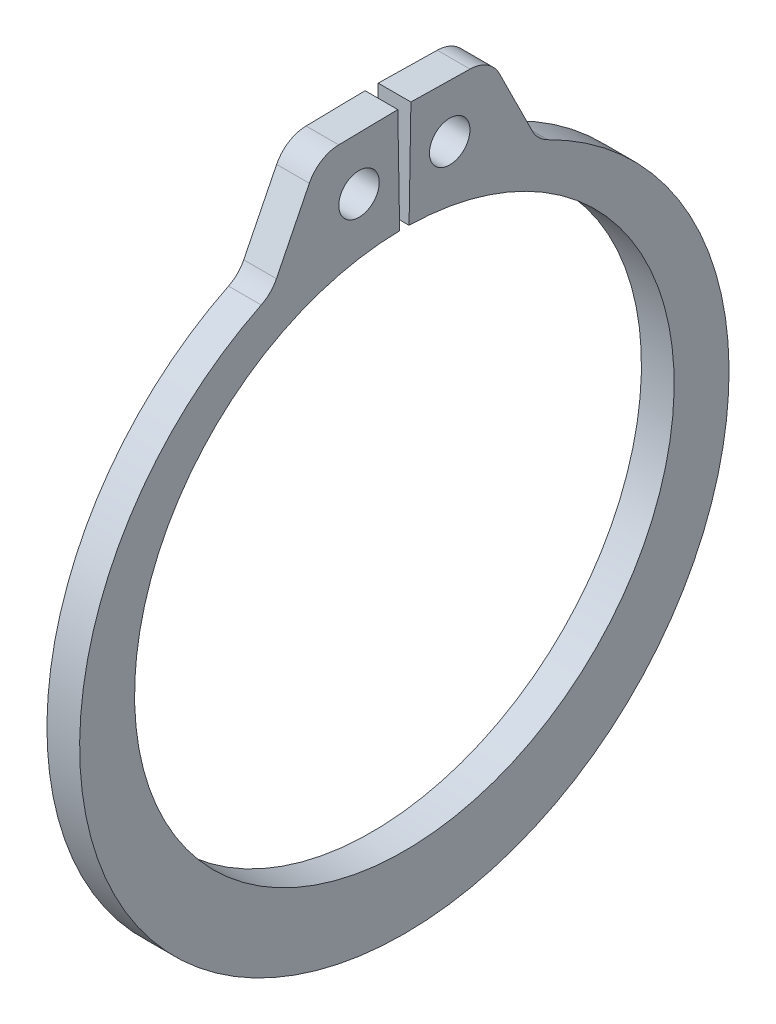
ISO-10303-21;
HEADER;
FILE_DESCRIPTION(('STEP AP214'),'2;1');
FILE_NAME('part.step','',(''),(''),'','','');
FILE_SCHEMA(('AUTOMOTIVE_DESIGN { 1 0 10303 214 1 1 1 1 }'));
ENDSEC;
DATA;
#1=APPLICATION_CONTEXT('core data for automotive mechanical design processes');
#2=APPLICATION_PROTOCOL_DEFINITION('international standard','automotive_design',2000,#1);
#3=PRODUCT_CONTEXT('',#1,'mechanical');
#4=PRODUCT('Part','Part','',(#3));
#5=PRODUCT_RELATED_PRODUCT_CATEGORY('part','',(#4));
#6=PRODUCT_DEFINITION_FORMATION('','',#4);
#7=PRODUCT_DEFINITION_CONTEXT('part definition',#1,'design');
#8=PRODUCT_DEFINITION('design','',#6,#7);
#9=PRODUCT_DEFINITION_SHAPE('','',#8);
#10=(LENGTH_UNIT() NAMED_UNIT(*) SI_UNIT(.MILLI.,.METRE.));
#11=(NAMED_UNIT(*) PLANE_ANGLE_UNIT() SI_UNIT($,.RADIAN.));
#12=(NAMED_UNIT(*) SI_UNIT($,.STERADIAN.) SOLID_ANGLE_UNIT());
#13=UNCERTAINTY_MEASURE_WITH_UNIT(LENGTH_MEASURE(1.E-05),#10,'distance_accuracy_value','');
#14=(GEOMETRIC_REPRESENTATION_CONTEXT(3) GLOBAL_UNCERTAINTY_ASSIGNED_CONTEXT((#13)) GLOBAL_UNIT_ASSIGNED_CONTEXT((#10,
#11,#12)) REPRESENTATION_CONTEXT('',''));
#15=CARTESIAN_POINT('',(0.,0.,0.));
#16=DIRECTION('',(0.,0.,1.));
#17=DIRECTION('',(1.,0.,0.));
#18=AXIS2_PLACEMENT_3D('',#15,#16,#17);
#19=CARTESIAN_POINT('',(0.5334,0.,0.));
#20=DIRECTION('',(1.,0.,0.));
#21=DIRECTION('',(0.,0.,1.));
#22=AXIS2_PLACEMENT_3D('',#19,#20,#21);
#23=PLANE('',#22);
#24=CARTESIAN_POINT('',(0.5334,10.5040886416162,1.47894687499924));
#25=DIRECTION('',(1.,0.,0.));
#26=DIRECTION('',(0.,0.,-1.));
#27=AXIS2_PLACEMENT_3D('',#24,#25,#26);
#28=CIRCLE('',#27,0.6604);
#29=CARTESIAN_POINT('',(0.5334,10.5040886416162,0.818546874999241));
#30=VERTEX_POINT('',#29);
#31=EDGE_CURVE('E123',#30,#30,#28,.T.);
#32=ORIENTED_EDGE('',*,*,#31,.F.);
#33=EDGE_LOOP('',(#32));
#34=FACE_BOUND('',#33,.T.);
#35=CARTESIAN_POINT('',(0.5334,0.,0.));
#36=DIRECTION('',(1.,0.,0.));
#37=DIRECTION('',(0.,0.,-1.));
#38=AXIS2_PLACEMENT_3D('',#35,#36,#37);
#39=CIRCLE('',#38,8.8011);
#40=CARTESIAN_POINT('',(0.5334,8.79975954984091,0.153600374295176));
#41=VERTEX_POINT('',#40);
#42=CARTESIAN_POINT('',(0.5334,8.79975954984091,-0.153600374295176));
#43=VERTEX_POINT('',#42);
#44=EDGE_CURVE('E153',#41,#43,#39,.T.);
#45=ORIENTED_EDGE('',*,*,#44,.F.);
#46=DIRECTION('',(0.,0.999847695156391,0.0174524064372835));
#47=VECTOR('',#46,1.);
#48=CARTESIAN_POINT('',(0.5334,8.79975954984091,0.153600374295176));
#49=LINE('',#48,#47);
#50=CARTESIAN_POINT('',(0.5334,12.2536334279892,0.213887967092128));
#51=VERTEX_POINT('',#50);
#52=EDGE_CURVE('E199',#51,#41,#49,.F.);
#53=ORIENTED_EDGE('',*,*,#52,.F.);
#54=DIRECTION('',(0.,-0.0174524064372834,0.999847695156391));
#55=VECTOR('',#54,1.);
#56=CARTESIAN_POINT('',(0.5334,12.2536334279892,0.213887967092128));
#57=LINE('',#56,#55);
#58=CARTESIAN_POINT('',(0.5334,12.21999978275,2.14075821234738));
#59=VERTEX_POINT('',#58);
#60=EDGE_CURVE('E192',#59,#51,#57,.F.);
#61=ORIENTED_EDGE('',*,*,#60,.F.);
#62=CARTESIAN_POINT('',(0.5334,11.1279661301002,2.12169669403658));
#63=DIRECTION('',(1.,0.,0.));
#64=DIRECTION('',(0.,0.,-1.));
#65=AXIS2_PLACEMENT_3D('',#62,#63,#64);
#66=CIRCLE('',#65,1.0922);
#67=CARTESIAN_POINT('',(0.5334,11.6141614114107,3.09971253666458));
#68=VERTEX_POINT('',#67);
#69=EDGE_CURVE('E148',#59,#68,#66,.T.);
#70=ORIENTED_EDGE('',*,*,#69,.T.);
#71=DIRECTION('',(0.,-0.895454900776411,0.445152244378829));
#72=VECTOR('',#71,1.);
#73=CARTESIAN_POINT('',(0.5334,12.2084177333914,2.80429337570331));
#74=LINE('',#73,#72);
#75=CARTESIAN_POINT('',(0.5334,9.45539137797145,4.17288922557434));
#76=VERTEX_POINT('',#75);
#77=EDGE_CURVE('E152',#76,#68,#74,.F.);
#78=ORIENTED_EDGE('',*,*,#77,.F.);
#79=CARTESIAN_POINT('',(0.5334,9.941586659282,5.15090506820234));
#80=DIRECTION('',(1.,0.,0.));
#81=DIRECTION('',(0.,0.,-1.));
#82=AXIS2_PLACEMENT_3D('',#79,#80,#81);
#83=CIRCLE('',#82,1.0922);
#84=CARTESIAN_POINT('',(0.5334,8.96124610534802,4.66941442622431));
#85=VERTEX_POINT('',#84);
#86=EDGE_CURVE('E144',#85,#76,#83,.T.);
#87=ORIENTED_EDGE('',*,*,#86,.F.);
#88=CARTESIAN_POINT('',(0.5334,-0.545929997486656,0.));
#89=DIRECTION('',(1.,0.,0.));
#90=DIRECTION('',(0.,0.,-1.));
#91=AXIS2_PLACEMENT_3D('',#88,#89,#90);
#92=CIRCLE('',#91,10.5919700025133);
#93=CARTESIAN_POINT('',(0.5334,8.96124610534802,-4.66941442622431));
#94=VERTEX_POINT('',#93);
#95=EDGE_CURVE('E137',#85,#94,#92,.T.);
#96=ORIENTED_EDGE('',*,*,#95,.T.);
#97=CARTESIAN_POINT('',(0.5334,9.941586659282,-5.15090506820234));
#98=DIRECTION('',(1.,0.,0.));
#99=DIRECTION('',(0.,0.,-1.));
#100=AXIS2_PLACEMENT_3D('',#97,#98,#99);
#101=CIRCLE('',#100,1.0922);
#102=CARTESIAN_POINT('',(0.5334,9.45539137797145,-4.17288922557434));
#103=VERTEX_POINT('',#102);
#104=EDGE_CURVE('E119',#103,#94,#101,.T.);
#105=ORIENTED_EDGE('',*,*,#104,.F.);
#106=DIRECTION('',(0.,0.895454900776411,0.445152244378829));
#107=VECTOR('',#106,1.);
#108=CARTESIAN_POINT('',(0.5334,12.2084177333914,-2.80429337570331));
#109=LINE('',#108,#107);
#110=CARTESIAN_POINT('',(0.5334,11.6141614114107,-3.09971253666458));
#111=VERTEX_POINT('',#110);
#112=EDGE_CURVE('E124',#111,#103,#109,.F.);
#113=ORIENTED_EDGE('',*,*,#112,.F.);
#114=CARTESIAN_POINT('',(0.5334,11.1279661301002,-2.12169669403658));
#115=DIRECTION('',(1.,0.,0.));
#116=DIRECTION('',(0.,0.,-1.));
#117=AXIS2_PLACEMENT_3D('',#114,#115,#116);
#118=CIRCLE('',#117,1.0922);
#119=CARTESIAN_POINT('',(0.5334,12.21999978275,-2.14075821234738));
#120=VERTEX_POINT('',#119);
#121=EDGE_CURVE('E158',#111,#120,#118,.T.);
#122=ORIENTED_EDGE('',*,*,#121,.T.);
#123=DIRECTION('',(0.,0.0174524064372834,0.999847695156391));
#124=VECTOR('',#123,1.);
#125=CARTESIAN_POINT('',(0.5334,12.2536334279892,-0.213887967092128));
#126=LINE('',#125,#124);
#127=CARTESIAN_POINT('',(0.5334,12.2536334279892,-0.213887967092128));
#128=VERTEX_POINT('',#127);
#129=EDGE_CURVE('E161',#128,#120,#126,.F.);
#130=ORIENTED_EDGE('',*,*,#129,.F.);
#131=DIRECTION('',(0.,-0.999847695156391,0.0174524064372835));
#132=VECTOR('',#131,1.);
#133=CARTESIAN_POINT('',(0.5334,8.79975954984091,-0.153600374295176));
#134=LINE('',#133,#132);
#135=EDGE_CURVE('E204',#43,#128,#134,.F.);
#136=ORIENTED_EDGE('',*,*,#135,.F.);
#137=EDGE_LOOP('',(#45,#53,#61,#70,#78,#87,#96,#105,#113,#122,#130,#136));
#138=FACE_BOUND('',#137,.T.);
#139=CARTESIAN_POINT('',(0.5334,10.5040886416162,-1.47894687499924));
#140=DIRECTION('',(1.,0.,0.));
#141=DIRECTION('',(0.,0.,-1.));
#142=AXIS2_PLACEMENT_3D('',#139,#140,#141);
#143=CIRCLE('',#142,0.6604);
#144=CARTESIAN_POINT('',(0.5334,10.5040886416162,-2.13934687499924));
#145=VERTEX_POINT('',#144);
#146=EDGE_CURVE('E40',#145,#145,#143,.T.);
#147=ORIENTED_EDGE('',*,*,#146,.F.);
#148=EDGE_LOOP('',(#147));
#149=FACE_BOUND('',#148,.T.);
#150=ADVANCED_FACE('F37',(#34,#138,#149),#23,.T.);
#151=CARTESIAN_POINT('',(0.5334,10.5040886416162,-1.47894687499924));
#152=DIRECTION('',(-1.,0.,0.));
#153=DIRECTION('',(0.,0.,-1.));
#154=AXIS2_PLACEMENT_3D('',#151,#152,#153);
#155=CYLINDRICAL_SURFACE('',#154,0.6604);
#156=CARTESIAN_POINT('',(-0.5334,10.5040886416162,-1.47894687499924));
#157=DIRECTION('',(1.,0.,0.));
#158=DIRECTION('',(0.,0.,-1.));
#159=AXIS2_PLACEMENT_3D('',#156,#157,#158);
#160=CIRCLE('',#159,0.6604);
#161=CARTESIAN_POINT('',(-0.5334,10.5040886416162,-2.13934687499924));
#162=VERTEX_POINT('',#161);
#163=EDGE_CURVE('E164',#162,#162,#160,.T.);
#164=ORIENTED_EDGE('',*,*,#163,.F.);
#165=EDGE_LOOP('',(#164));
#166=FACE_BOUND('',#165,.T.);
#167=ORIENTED_EDGE('',*,*,#146,.T.);
#168=EDGE_LOOP('',(#167));
#169=FACE_BOUND('',#168,.T.);
#170=ADVANCED_FACE('F297',(#166,#169),#155,.F.);
#171=CARTESIAN_POINT('',(0.5334,9.941586659282,-5.15090506820234));
#172=DIRECTION('',(-1.,0.,0.));
#173=DIRECTION('',(0.,0.,-1.));
#174=AXIS2_PLACEMENT_3D('',#171,#172,#173);
#175=CYLINDRICAL_SURFACE('',#174,1.0922);
#176=DIRECTION('',(1.,0.,0.));
#177=VECTOR('',#176,1.);
#178=CARTESIAN_POINT('',(0.5334,9.45539137797145,-4.17288922557434));
#179=LINE('',#178,#177);
#180=CARTESIAN_POINT('',(-0.5334,9.45539137797145,-4.17288922557434));
#181=VERTEX_POINT('',#180);
#182=EDGE_CURVE('E114',#103,#181,#179,.F.);
#183=ORIENTED_EDGE('',*,*,#182,.F.);
#184=ORIENTED_EDGE('',*,*,#104,.T.);
#185=DIRECTION('',(-1.,0.,0.));
#186=VECTOR('',#185,1.);
#187=CARTESIAN_POINT('',(0.5334,8.96124610534802,-4.66941442622431));
#188=LINE('',#187,#186);
#189=CARTESIAN_POINT('',(-0.5334,8.96124610534802,-4.66941442622431));
#190=VERTEX_POINT('',#189);
#191=EDGE_CURVE('E138',#94,#190,#188,.T.);
#192=ORIENTED_EDGE('',*,*,#191,.T.);
#193=CARTESIAN_POINT('',(-0.5334,9.941586659282,-5.15090506820234));
#194=DIRECTION('',(1.,0.,0.));
#195=DIRECTION('',(0.,0.,-1.));
#196=AXIS2_PLACEMENT_3D('',#193,#194,#195);
#197=CIRCLE('',#196,1.0922);
#198=EDGE_CURVE('E122',#181,#190,#197,.T.);
#199=ORIENTED_EDGE('',*,*,#198,.F.);
#200=EDGE_LOOP('',(#183,#184,#192,#199));
#201=FACE_BOUND('',#200,.T.);
#202=ADVANCED_FACE('F116',(#201),#175,.F.);
#203=CARTESIAN_POINT('',(0.5334,-0.545929997486656,0.));
#204=DIRECTION('',(-1.,0.,0.));
#205=DIRECTION('',(0.,0.,-1.));
#206=AXIS2_PLACEMENT_3D('',#203,#204,#205);
#207=CYLINDRICAL_SURFACE('',#206,10.5919700025133);
#208=CARTESIAN_POINT('',(-0.5334,-0.545929997486656,0.));
#209=DIRECTION('',(1.,0.,0.));
#210=DIRECTION('',(0.,0.,-1.));
#211=AXIS2_PLACEMENT_3D('',#208,#209,#210);
#212=CIRCLE('',#211,10.5919700025133);
#213=CARTESIAN_POINT('',(-0.5334,8.96124610534802,4.66941442622431));
#214=VERTEX_POINT('',#213);
#215=EDGE_CURVE('E168',#190,#214,#212,.F.);
#216=ORIENTED_EDGE('',*,*,#215,.F.);
#217=ORIENTED_EDGE('',*,*,#191,.F.);
#218=ORIENTED_EDGE('',*,*,#95,.F.);
#219=DIRECTION('',(-1.,0.,0.));
#220=VECTOR('',#219,1.);
#221=CARTESIAN_POINT('',(0.5334,8.96124610534802,4.66941442622431));
#222=LINE('',#221,#220);
#223=EDGE_CURVE('E143',#214,#85,#222,.F.);
#224=ORIENTED_EDGE('',*,*,#223,.F.);
#225=EDGE_LOOP('',(#216,#217,#218,#224));
#226=FACE_BOUND('',#225,.T.);
#227=ADVANCED_FACE('F287',(#226),#207,.T.);
#228=CARTESIAN_POINT('',(0.5334,9.941586659282,5.15090506820234));
#229=DIRECTION('',(-1.,0.,0.));
#230=DIRECTION('',(0.,0.,-1.));
#231=AXIS2_PLACEMENT_3D('',#228,#229,#230);
#232=CYLINDRICAL_SURFACE('',#231,1.0922);
#233=ORIENTED_EDGE('',*,*,#223,.T.);
#234=ORIENTED_EDGE('',*,*,#86,.T.);
#235=DIRECTION('',(1.,0.,0.));
#236=VECTOR('',#235,1.);
#237=CARTESIAN_POINT('',(0.5334,9.45539137797145,4.17288922557434));
#238=LINE('',#237,#236);
#239=CARTESIAN_POINT('',(-0.5334,9.45539137797145,4.17288922557434));
#240=VERTEX_POINT('',#239);
#241=EDGE_CURVE('E147',#240,#76,#238,.T.);
#242=ORIENTED_EDGE('',*,*,#241,.F.);
#243=CARTESIAN_POINT('',(-0.5334,9.941586659282,5.15090506820234));
#244=DIRECTION('',(1.,0.,0.));
#245=DIRECTION('',(0.,0.,-1.));
#246=AXIS2_PLACEMENT_3D('',#243,#244,#245);
#247=CIRCLE('',#246,1.0922);
#248=EDGE_CURVE('E171',#214,#240,#247,.T.);
#249=ORIENTED_EDGE('',*,*,#248,.F.);
#250=EDGE_LOOP('',(#233,#234,#242,#249));
#251=FACE_BOUND('',#250,.T.);
#252=ADVANCED_FACE('F283',(#251),#232,.F.);
#253=CARTESIAN_POINT('',(0.5334,12.2084177333914,2.80429337570331));
#254=DIRECTION('',(0.,-0.445152244378829,-0.895454900776411));
#255=DIRECTION('',(0.,-0.895454900776411,0.445152244378829));
#256=AXIS2_PLACEMENT_3D('',#253,#254,#255);
#257=PLANE('',#256);
#258=ORIENTED_EDGE('',*,*,#241,.T.);
#259=ORIENTED_EDGE('',*,*,#77,.T.);
#260=DIRECTION('',(-1.,0.,0.));
#261=VECTOR('',#260,1.);
#262=CARTESIAN_POINT('',(0.5334,11.6141614114107,3.09971253666458));
#263=LINE('',#262,#261);
#264=CARTESIAN_POINT('',(-0.5334,11.6141614114107,3.09971253666458));
#265=VERTEX_POINT('',#264);
#266=EDGE_CURVE('E151',#68,#265,#263,.T.);
#267=ORIENTED_EDGE('',*,*,#266,.T.);
#268=DIRECTION('',(0.,0.895454900776411,-0.445152244378828));
#269=VECTOR('',#268,1.);
#270=CARTESIAN_POINT('',(-0.5334,9.45539137797145,4.17288922557434));
#271=LINE('',#270,#269);
#272=EDGE_CURVE('E174',#240,#265,#271,.T.);
#273=ORIENTED_EDGE('',*,*,#272,.F.);
#274=EDGE_LOOP('',(#258,#259,#267,#273));
#275=FACE_BOUND('',#274,.T.);
#276=ADVANCED_FACE('F280',(#275),#257,.F.);
#277=CARTESIAN_POINT('',(0.5334,11.1279661301002,2.12169669403658));
#278=DIRECTION('',(-1.,0.,0.));
#279=DIRECTION('',(0.,0.,-1.));
#280=AXIS2_PLACEMENT_3D('',#277,#278,#279);
#281=CYLINDRICAL_SURFACE('',#280,1.0922);
#282=CARTESIAN_POINT('',(-0.5334,11.1279661301002,2.12169669403658));
#283=DIRECTION('',(1.,0.,0.));
#284=DIRECTION('',(0.,0.,-1.));
#285=AXIS2_PLACEMENT_3D('',#282,#283,#284);
#286=CIRCLE('',#285,1.0922);
#287=CARTESIAN_POINT('',(-0.5334,12.21999978275,2.14075821234738));
#288=VERTEX_POINT('',#287);
#289=EDGE_CURVE('E175',#265,#288,#286,.F.);
#290=ORIENTED_EDGE('',*,*,#289,.F.);
#291=ORIENTED_EDGE('',*,*,#266,.F.);
#292=ORIENTED_EDGE('',*,*,#69,.F.);
#293=DIRECTION('',(1.,0.,0.));
#294=VECTOR('',#293,1.);
#295=CARTESIAN_POINT('',(0.5334,12.21999978275,2.14075821234738));
#296=LINE('',#295,#294);
#297=EDGE_CURVE('E196',#288,#59,#296,.T.);
#298=ORIENTED_EDGE('',*,*,#297,.F.);
#299=EDGE_LOOP('',(#290,#291,#292,#298));
#300=FACE_BOUND('',#299,.T.);
#301=ADVANCED_FACE('F277',(#300),#281,.T.);
#302=CARTESIAN_POINT('',(0.5334,12.2536334279892,0.213887967092128));
#303=DIRECTION('',(0.,-0.999847695156391,-0.0174524064372834));
#304=DIRECTION('',(0.,-0.0174524064372834,0.999847695156391));
#305=AXIS2_PLACEMENT_3D('',#302,#303,#304);
#306=PLANE('',#305);
#307=ORIENTED_EDGE('',*,*,#297,.T.);
#308=ORIENTED_EDGE('',*,*,#60,.T.);
#309=DIRECTION('',(1.,0.,0.));
#310=VECTOR('',#309,1.);
#311=CARTESIAN_POINT('',(0.5334,12.2536334279892,0.213887967092128));
#312=LINE('',#311,#310);
#313=CARTESIAN_POINT('',(-0.5334,12.2536334279892,0.213887967092128));
#314=VERTEX_POINT('',#313);
#315=EDGE_CURVE('E195',#314,#51,#312,.T.);
#316=ORIENTED_EDGE('',*,*,#315,.F.);
#317=DIRECTION('',(0.,0.0174524064372837,-0.999847695156391));
#318=VECTOR('',#317,1.);
#319=CARTESIAN_POINT('',(-0.5334,12.21999978275,2.14075821234738));
#320=LINE('',#319,#318);
#321=EDGE_CURVE('E178',#288,#314,#320,.T.);
#322=ORIENTED_EDGE('',*,*,#321,.F.);
#323=EDGE_LOOP('',(#307,#308,#316,#322));
#324=FACE_BOUND('',#323,.T.);
#325=ADVANCED_FACE('F273',(#324),#306,.F.);
#326=CARTESIAN_POINT('',(0.5334,8.79975954984091,0.153600374295176));
#327=DIRECTION('',(0.,-0.0174524064372835,0.999847695156391));
#328=DIRECTION('',(0.,0.999847695156391,0.0174524064372835));
#329=AXIS2_PLACEMENT_3D('',#326,#327,#328);
#330=PLANE('',#329);
#331=DIRECTION('',(-1.,0.,0.));
#332=VECTOR('',#331,1.);
#333=CARTESIAN_POINT('',(0.5334,8.79975954984091,0.153600374295176));
#334=LINE('',#333,#332);
#335=CARTESIAN_POINT('',(-0.5334,8.79975954984091,0.153600374295176));
#336=VERTEX_POINT('',#335);
#337=EDGE_CURVE('E157',#336,#41,#334,.F.);
#338=ORIENTED_EDGE('',*,*,#337,.F.);
#339=DIRECTION('',(0.,-0.999847695156391,-0.0174524064372835));
#340=VECTOR('',#339,1.);
#341=CARTESIAN_POINT('',(-0.5334,12.2536334279892,0.213887967092128));
#342=LINE('',#341,#340);
#343=EDGE_CURVE('E183',#314,#336,#342,.T.);
#344=ORIENTED_EDGE('',*,*,#343,.F.);
#345=ORIENTED_EDGE('',*,*,#315,.T.);
#346=ORIENTED_EDGE('',*,*,#52,.T.);
#347=EDGE_LOOP('',(#338,#344,#345,#346));
#348=FACE_BOUND('',#347,.T.);
#349=ADVANCED_FACE('F269',(#348),#330,.F.);
#350=CARTESIAN_POINT('',(0.5334,0.,0.));
#351=DIRECTION('',(-1.,0.,0.));
#352=DIRECTION('',(0.,0.,-1.));
#353=AXIS2_PLACEMENT_3D('',#350,#351,#352);
#354=CYLINDRICAL_SURFACE('',#353,8.8011);
#355=ORIENTED_EDGE('',*,*,#44,.T.);
#356=DIRECTION('',(1.,0.,0.));
#357=VECTOR('',#356,1.);
#358=CARTESIAN_POINT('',(0.5334,8.79975954984091,-0.153600374295176));
#359=LINE('',#358,#357);
#360=CARTESIAN_POINT('',(-0.5334,8.79975954984091,-0.153600374295176));
#361=VERTEX_POINT('',#360);
#362=EDGE_CURVE('E156',#361,#43,#359,.T.);
#363=ORIENTED_EDGE('',*,*,#362,.F.);
#364=CARTESIAN_POINT('',(-0.5334,0.,0.));
#365=DIRECTION('',(1.,0.,0.));
#366=DIRECTION('',(0.,0.,-1.));
#367=AXIS2_PLACEMENT_3D('',#364,#365,#366);
#368=CIRCLE('',#367,8.8011);
#369=EDGE_CURVE('E179',#336,#361,#368,.T.);
#370=ORIENTED_EDGE('',*,*,#369,.F.);
#371=ORIENTED_EDGE('',*,*,#337,.T.);
#372=EDGE_LOOP('',(#355,#363,#370,#371));
#373=FACE_BOUND('',#372,.T.);
#374=ADVANCED_FACE('F264',(#373),#354,.F.);
#375=CARTESIAN_POINT('',(0.5334,8.79975954984091,-0.153600374295176));
#376=DIRECTION('',(0.,-0.0174524064372835,-0.999847695156391));
#377=DIRECTION('',(0.,-0.999847695156391,0.0174524064372835));
#378=AXIS2_PLACEMENT_3D('',#375,#376,#377);
#379=PLANE('',#378);
#380=DIRECTION('',(1.,0.,0.));
#381=VECTOR('',#380,1.);
#382=CARTESIAN_POINT('',(0.5334,12.2536334279892,-0.213887967092128));
#383=LINE('',#382,#381);
#384=CARTESIAN_POINT('',(-0.5334,12.2536334279892,-0.213887967092128));
#385=VERTEX_POINT('',#384);
#386=EDGE_CURVE('E207',#385,#128,#383,.T.);
#387=ORIENTED_EDGE('',*,*,#386,.F.);
#388=DIRECTION('',(0.,0.999847695156391,-0.0174524064372835));
#389=VECTOR('',#388,1.);
#390=CARTESIAN_POINT('',(-0.5334,8.79975954984091,-0.153600374295176));
#391=LINE('',#390,#389);
#392=EDGE_CURVE('E182',#361,#385,#391,.T.);
#393=ORIENTED_EDGE('',*,*,#392,.F.);
#394=ORIENTED_EDGE('',*,*,#362,.T.);
#395=ORIENTED_EDGE('',*,*,#135,.T.);
#396=EDGE_LOOP('',(#387,#393,#394,#395));
#397=FACE_BOUND('',#396,.T.);
#398=ADVANCED_FACE('F261',(#397),#379,.F.);
#399=CARTESIAN_POINT('',(0.5334,12.2536334279892,-0.213887967092128));
#400=DIRECTION('',(0.,-0.999847695156391,0.0174524064372834));
#401=DIRECTION('',(0.,0.0174524064372834,0.999847695156391));
#402=AXIS2_PLACEMENT_3D('',#399,#400,#401);
#403=PLANE('',#402);
#404=DIRECTION('',(-1.,0.,0.));
#405=VECTOR('',#404,1.);
#406=CARTESIAN_POINT('',(0.5334,12.21999978275,-2.14075821234738));
#407=LINE('',#406,#405);
#408=CARTESIAN_POINT('',(-0.5334,12.21999978275,-2.14075821234738));
#409=VERTEX_POINT('',#408);
#410=EDGE_CURVE('E160',#120,#409,#407,.T.);
#411=ORIENTED_EDGE('',*,*,#410,.T.);
#412=DIRECTION('',(0.,-0.0174524064372837,-0.999847695156391));
#413=VECTOR('',#412,1.);
#414=CARTESIAN_POINT('',(-0.5334,12.2536334279892,-0.213887967092128));
#415=LINE('',#414,#413);
#416=EDGE_CURVE('E186',#385,#409,#415,.T.);
#417=ORIENTED_EDGE('',*,*,#416,.F.);
#418=ORIENTED_EDGE('',*,*,#386,.T.);
#419=ORIENTED_EDGE('',*,*,#129,.T.);
#420=EDGE_LOOP('',(#411,#417,#418,#419));
#421=FACE_BOUND('',#420,.T.);
#422=ADVANCED_FACE('F258',(#421),#403,.F.);
#423=CARTESIAN_POINT('',(0.5334,11.1279661301002,-2.12169669403658));
#424=DIRECTION('',(-1.,0.,0.));
#425=DIRECTION('',(0.,0.,-1.));
#426=AXIS2_PLACEMENT_3D('',#423,#424,#425);
#427=CYLINDRICAL_SURFACE('',#426,1.0922);
#428=CARTESIAN_POINT('',(-0.5334,11.1279661301002,-2.12169669403658));
#429=DIRECTION('',(1.,0.,0.));
#430=DIRECTION('',(0.,0.,-1.));
#431=AXIS2_PLACEMENT_3D('',#428,#429,#430);
#432=CIRCLE('',#431,1.0922);
#433=CARTESIAN_POINT('',(-0.5334,11.6141614114107,-3.09971253666458));
#434=VERTEX_POINT('',#433);
#435=EDGE_CURVE('E184',#409,#434,#432,.F.);
#436=ORIENTED_EDGE('',*,*,#435,.F.);
#437=ORIENTED_EDGE('',*,*,#410,.F.);
#438=ORIENTED_EDGE('',*,*,#121,.F.);
#439=DIRECTION('',(1.,0.,0.));
#440=VECTOR('',#439,1.);
#441=CARTESIAN_POINT('',(0.5334,11.6141614114107,-3.09971253666458));
#442=LINE('',#441,#440);
#443=EDGE_CURVE('E128',#434,#111,#442,.T.);
#444=ORIENTED_EDGE('',*,*,#443,.F.);
#445=EDGE_LOOP('',(#436,#437,#438,#444));
#446=FACE_BOUND('',#445,.T.);
#447=ADVANCED_FACE('F253',(#446),#427,.T.);
#448=CARTESIAN_POINT('',(0.5334,12.2084177333914,-2.80429337570331));
#449=DIRECTION('',(0.,-0.445152244378829,0.895454900776411));
#450=DIRECTION('',(0.,0.895454900776411,0.445152244378829));
#451=AXIS2_PLACEMENT_3D('',#448,#449,#450);
#452=PLANE('',#451);
#453=ORIENTED_EDGE('',*,*,#182,.T.);
#454=DIRECTION('',(0.,-0.895454900776411,-0.445152244378828));
#455=VECTOR('',#454,1.);
#456=CARTESIAN_POINT('',(-0.5334,11.6141614114107,-3.09971253666458));
#457=LINE('',#456,#455);
#458=EDGE_CURVE('E46',#434,#181,#457,.T.);
#459=ORIENTED_EDGE('',*,*,#458,.F.);
#460=ORIENTED_EDGE('',*,*,#443,.T.);
#461=ORIENTED_EDGE('',*,*,#112,.T.);
#462=EDGE_LOOP('',(#453,#459,#460,#461));
#463=FACE_BOUND('',#462,.T.);
#464=ADVANCED_FACE('F127',(#463),#452,.F.);
#465=CARTESIAN_POINT('',(0.5334,10.5040886416162,1.47894687499924));
#466=DIRECTION('',(-1.,0.,0.));
#467=DIRECTION('',(0.,0.,-1.));
#468=AXIS2_PLACEMENT_3D('',#465,#466,#467);
#469=CYLINDRICAL_SURFACE('',#468,0.6604);
#470=CARTESIAN_POINT('',(-0.5334,10.5040886416162,1.47894687499924));
#471=DIRECTION('',(1.,0.,0.));
#472=DIRECTION('',(0.,0.,-1.));
#473=AXIS2_PLACEMENT_3D('',#470,#471,#472);
#474=CIRCLE('',#473,0.6604);
#475=CARTESIAN_POINT('',(-0.5334,10.5040886416162,0.818546874999241));
#476=VERTEX_POINT('',#475);
#477=EDGE_CURVE('E11',#476,#476,#474,.T.);
#478=ORIENTED_EDGE('',*,*,#477,.F.);
#479=EDGE_LOOP('',(#478));
#480=FACE_BOUND('',#479,.T.);
#481=ORIENTED_EDGE('',*,*,#31,.T.);
#482=EDGE_LOOP('',(#481));
#483=FACE_BOUND('',#482,.T.);
#484=ADVANCED_FACE('F307',(#480,#483),#469,.F.);
#485=CARTESIAN_POINT('',(-0.5334,0.,0.));
#486=DIRECTION('',(1.,0.,0.));
#487=DIRECTION('',(0.,0.,1.));
#488=AXIS2_PLACEMENT_3D('',#485,#486,#487);
#489=PLANE('',#488);
#490=ORIENTED_EDGE('',*,*,#477,.T.);
#491=EDGE_LOOP('',(#490));
#492=FACE_BOUND('',#491,.T.);
#493=ORIENTED_EDGE('',*,*,#435,.T.);
#494=ORIENTED_EDGE('',*,*,#458,.T.);
#495=ORIENTED_EDGE('',*,*,#198,.T.);
#496=ORIENTED_EDGE('',*,*,#215,.T.);
#497=ORIENTED_EDGE('',*,*,#248,.T.);
#498=ORIENTED_EDGE('',*,*,#272,.T.);
#499=ORIENTED_EDGE('',*,*,#289,.T.);
#500=ORIENTED_EDGE('',*,*,#321,.T.);
#501=ORIENTED_EDGE('',*,*,#343,.T.);
#502=ORIENTED_EDGE('',*,*,#369,.T.);
#503=ORIENTED_EDGE('',*,*,#392,.T.);
#504=ORIENTED_EDGE('',*,*,#416,.T.);
#505=EDGE_LOOP('',(#493,#494,#495,#496,#497,#498,#499,#500,#501,#502,#503,#504));
#506=FACE_BOUND('',#505,.T.);
#507=ORIENTED_EDGE('',*,*,#163,.T.);
#508=EDGE_LOOP('',(#507));
#509=FACE_BOUND('',#508,.T.);
#510=ADVANCED_FACE('F249',(#492,#506,#509),#489,.F.);
#511=CLOSED_SHELL('',(#150,#170,#202,#227,#252,#276,#301,#325,#349,#374,#398,#422,#447,#464,
#484,#510));
#512=MANIFOLD_SOLID_BREP('B2',#511);
#513=ADVANCED_BREP_SHAPE_REPRESENTATION('',(#18,#512),#14);
#514=SHAPE_DEFINITION_REPRESENTATION(#9,#513);
ENDSEC;
END-ISO-10303-21;
